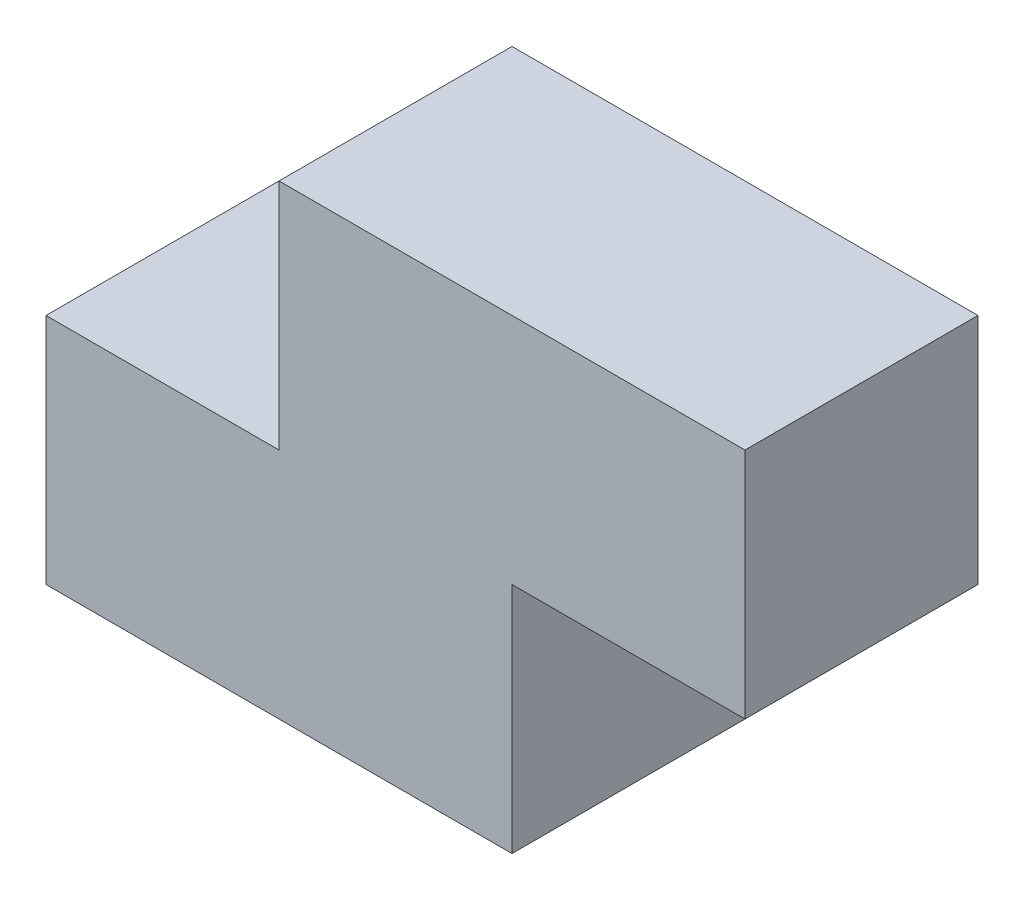
ISO-10303-21;
HEADER;
FILE_DESCRIPTION(('STEP AP214'),'2;1');
FILE_NAME('part.step','',(''),(''),'','','');
FILE_SCHEMA(('AUTOMOTIVE_DESIGN { 1 0 10303 214 1 1 1 1 }'));
ENDSEC;
DATA;
#1=APPLICATION_CONTEXT('core data for automotive mechanical design processes');
#2=APPLICATION_PROTOCOL_DEFINITION('international standard','automotive_design',2000,#1);
#3=PRODUCT_CONTEXT('',#1,'mechanical');
#4=PRODUCT('Part','Part','',(#3));
#5=PRODUCT_RELATED_PRODUCT_CATEGORY('part','',(#4));
#6=PRODUCT_DEFINITION_FORMATION('','',#4);
#7=PRODUCT_DEFINITION_CONTEXT('part definition',#1,'design');
#8=PRODUCT_DEFINITION('design','',#6,#7);
#9=PRODUCT_DEFINITION_SHAPE('','',#8);
#10=(LENGTH_UNIT() NAMED_UNIT(*) SI_UNIT(.MILLI.,.METRE.));
#11=(NAMED_UNIT(*) PLANE_ANGLE_UNIT() SI_UNIT($,.RADIAN.));
#12=(NAMED_UNIT(*) SI_UNIT($,.STERADIAN.) SOLID_ANGLE_UNIT());
#13=UNCERTAINTY_MEASURE_WITH_UNIT(LENGTH_MEASURE(1.E-05),#10,'distance_accuracy_value','');
#14=(GEOMETRIC_REPRESENTATION_CONTEXT(3) GLOBAL_UNCERTAINTY_ASSIGNED_CONTEXT((#13)) GLOBAL_UNIT_ASSIGNED_CONTEXT((#10,
#11,#12)) REPRESENTATION_CONTEXT('',''));
#15=CARTESIAN_POINT('',(0.,0.,0.));
#16=DIRECTION('',(0.,0.,1.));
#17=DIRECTION('',(1.,0.,0.));
#18=AXIS2_PLACEMENT_3D('',#15,#16,#17);
#19=CARTESIAN_POINT('',(0.,30.,30.));
#20=DIRECTION('',(1.,0.,0.));
#21=DIRECTION('',(0.,1.,0.));
#22=AXIS2_PLACEMENT_3D('',#19,#20,#21);
#23=PLANE('',#22);
#24=DIRECTION('',(0.,-1.,0.));
#25=VECTOR('',#24,1.);
#26=CARTESIAN_POINT('',(0.,30.,0.));
#27=LINE('',#26,#25);
#28=CARTESIAN_POINT('',(0.,30.,0.));
#29=VERTEX_POINT('',#28);
#30=CARTESIAN_POINT('',(0.,0.,0.));
#31=VERTEX_POINT('',#30);
#32=EDGE_CURVE('E129',#29,#31,#27,.T.);
#33=ORIENTED_EDGE('',*,*,#32,.T.);
#34=DIRECTION('',(0.,0.,-1.));
#35=VECTOR('',#34,1.);
#36=CARTESIAN_POINT('',(0.,0.,30.));
#37=LINE('',#36,#35);
#38=CARTESIAN_POINT('',(0.,0.,30.));
#39=VERTEX_POINT('',#38);
#40=EDGE_CURVE('E11',#39,#31,#37,.T.);
#41=ORIENTED_EDGE('',*,*,#40,.F.);
#42=DIRECTION('',(0.,-1.,0.));
#43=VECTOR('',#42,1.);
#44=CARTESIAN_POINT('',(0.,30.,30.));
#45=LINE('',#44,#43);
#46=CARTESIAN_POINT('',(0.,30.,30.));
#47=VERTEX_POINT('',#46);
#48=EDGE_CURVE('E143',#47,#39,#45,.T.);
#49=ORIENTED_EDGE('',*,*,#48,.F.);
#50=DIRECTION('',(0.,0.,-1.));
#51=VECTOR('',#50,1.);
#52=CARTESIAN_POINT('',(0.,30.,30.));
#53=LINE('',#52,#51);
#54=EDGE_CURVE('E125',#47,#29,#53,.T.);
#55=ORIENTED_EDGE('',*,*,#54,.T.);
#56=EDGE_LOOP('',(#33,#41,#49,#55));
#57=FACE_BOUND('',#56,.T.);
#58=ADVANCED_FACE('F33',(#57),#23,.F.);
#59=CARTESIAN_POINT('',(0.,0.,30.));
#60=DIRECTION('',(0.,1.,0.));
#61=DIRECTION('',(0.,0.,1.));
#62=AXIS2_PLACEMENT_3D('',#59,#60,#61);
#63=PLANE('',#62);
#64=DIRECTION('',(1.,0.,0.));
#65=VECTOR('',#64,1.);
#66=CARTESIAN_POINT('',(0.,0.,0.));
#67=LINE('',#66,#65);
#68=CARTESIAN_POINT('',(60.,0.,0.));
#69=VERTEX_POINT('',#68);
#70=EDGE_CURVE('E132',#31,#69,#67,.T.);
#71=ORIENTED_EDGE('',*,*,#70,.T.);
#72=DIRECTION('',(0.,0.,-1.));
#73=VECTOR('',#72,1.);
#74=CARTESIAN_POINT('',(60.,0.,30.));
#75=LINE('',#74,#73);
#76=CARTESIAN_POINT('',(60.,0.,30.));
#77=VERTEX_POINT('',#76);
#78=EDGE_CURVE('E41',#77,#69,#75,.T.);
#79=ORIENTED_EDGE('',*,*,#78,.F.);
#80=DIRECTION('',(1.,0.,0.));
#81=VECTOR('',#80,1.);
#82=CARTESIAN_POINT('',(0.,0.,30.));
#83=LINE('',#82,#81);
#84=EDGE_CURVE('E92',#39,#77,#83,.T.);
#85=ORIENTED_EDGE('',*,*,#84,.F.);
#86=ORIENTED_EDGE('',*,*,#40,.T.);
#87=EDGE_LOOP('',(#71,#79,#85,#86));
#88=FACE_BOUND('',#87,.T.);
#89=ADVANCED_FACE('F178',(#88),#63,.F.);
#90=CARTESIAN_POINT('',(60.,0.,30.));
#91=DIRECTION('',(-1.,0.,0.));
#92=DIRECTION('',(0.,0.,1.));
#93=AXIS2_PLACEMENT_3D('',#90,#91,#92);
#94=PLANE('',#93);
#95=DIRECTION('',(0.,1.,0.));
#96=VECTOR('',#95,1.);
#97=CARTESIAN_POINT('',(60.,0.,0.));
#98=LINE('',#97,#96);
#99=CARTESIAN_POINT('',(60.,30.,0.));
#100=VERTEX_POINT('',#99);
#101=EDGE_CURVE('E134',#69,#100,#98,.T.);
#102=ORIENTED_EDGE('',*,*,#101,.T.);
#103=DIRECTION('',(0.,0.,-1.));
#104=VECTOR('',#103,1.);
#105=CARTESIAN_POINT('',(60.,30.,30.));
#106=LINE('',#105,#104);
#107=CARTESIAN_POINT('',(60.,30.,30.));
#108=VERTEX_POINT('',#107);
#109=EDGE_CURVE('E150',#108,#100,#106,.T.);
#110=ORIENTED_EDGE('',*,*,#109,.F.);
#111=DIRECTION('',(0.,1.,0.));
#112=VECTOR('',#111,1.);
#113=CARTESIAN_POINT('',(60.,0.,30.));
#114=LINE('',#113,#112);
#115=EDGE_CURVE('E158',#77,#108,#114,.T.);
#116=ORIENTED_EDGE('',*,*,#115,.F.);
#117=ORIENTED_EDGE('',*,*,#78,.T.);
#118=EDGE_LOOP('',(#102,#110,#116,#117));
#119=FACE_BOUND('',#118,.T.);
#120=ADVANCED_FACE('F156',(#119),#94,.F.);
#121=CARTESIAN_POINT('',(60.,30.,30.));
#122=DIRECTION('',(0.,1.,0.));
#123=DIRECTION('',(-1.,0.,0.));
#124=AXIS2_PLACEMENT_3D('',#121,#122,#123);
#125=PLANE('',#124);
#126=DIRECTION('',(1.,0.,0.));
#127=VECTOR('',#126,1.);
#128=CARTESIAN_POINT('',(60.,30.,0.));
#129=LINE('',#128,#127);
#130=CARTESIAN_POINT('',(90.,30.,0.));
#131=VERTEX_POINT('',#130);
#132=EDGE_CURVE('E136',#100,#131,#129,.T.);
#133=ORIENTED_EDGE('',*,*,#132,.T.);
#134=DIRECTION('',(0.,0.,-1.));
#135=VECTOR('',#134,1.);
#136=CARTESIAN_POINT('',(90.,30.,30.));
#137=LINE('',#136,#135);
#138=CARTESIAN_POINT('',(90.,30.,30.));
#139=VERTEX_POINT('',#138);
#140=EDGE_CURVE('E147',#139,#131,#137,.T.);
#141=ORIENTED_EDGE('',*,*,#140,.F.);
#142=DIRECTION('',(1.,0.,0.));
#143=VECTOR('',#142,1.);
#144=CARTESIAN_POINT('',(60.,30.,30.));
#145=LINE('',#144,#143);
#146=EDGE_CURVE('E170',#108,#139,#145,.T.);
#147=ORIENTED_EDGE('',*,*,#146,.F.);
#148=ORIENTED_EDGE('',*,*,#109,.T.);
#149=EDGE_LOOP('',(#133,#141,#147,#148));
#150=FACE_BOUND('',#149,.T.);
#151=ADVANCED_FACE('F166',(#150),#125,.F.);
#152=CARTESIAN_POINT('',(90.,30.,30.));
#153=DIRECTION('',(-1.,0.,0.));
#154=DIRECTION('',(0.,0.,1.));
#155=AXIS2_PLACEMENT_3D('',#152,#153,#154);
#156=PLANE('',#155);
#157=DIRECTION('',(0.,1.,0.));
#158=VECTOR('',#157,1.);
#159=CARTESIAN_POINT('',(90.,30.,0.));
#160=LINE('',#159,#158);
#161=CARTESIAN_POINT('',(90.,60.,0.));
#162=VERTEX_POINT('',#161);
#163=EDGE_CURVE('E138',#131,#162,#160,.T.);
#164=ORIENTED_EDGE('',*,*,#163,.T.);
#165=DIRECTION('',(0.,0.,-1.));
#166=VECTOR('',#165,1.);
#167=CARTESIAN_POINT('',(90.,60.,30.));
#168=LINE('',#167,#166);
#169=CARTESIAN_POINT('',(90.,60.,30.));
#170=VERTEX_POINT('',#169);
#171=EDGE_CURVE('E120',#170,#162,#168,.T.);
#172=ORIENTED_EDGE('',*,*,#171,.F.);
#173=DIRECTION('',(0.,1.,0.));
#174=VECTOR('',#173,1.);
#175=CARTESIAN_POINT('',(90.,30.,30.));
#176=LINE('',#175,#174);
#177=EDGE_CURVE('E111',#139,#170,#176,.T.);
#178=ORIENTED_EDGE('',*,*,#177,.F.);
#179=ORIENTED_EDGE('',*,*,#140,.T.);
#180=EDGE_LOOP('',(#164,#172,#178,#179));
#181=FACE_BOUND('',#180,.T.);
#182=ADVANCED_FACE('F169',(#181),#156,.F.);
#183=CARTESIAN_POINT('',(90.,60.,30.));
#184=DIRECTION('',(0.,-1.,0.));
#185=DIRECTION('',(1.,0.,0.));
#186=AXIS2_PLACEMENT_3D('',#183,#184,#185);
#187=PLANE('',#186);
#188=DIRECTION('',(-1.,0.,0.));
#189=VECTOR('',#188,1.);
#190=CARTESIAN_POINT('',(90.,60.,0.));
#191=LINE('',#190,#189);
#192=CARTESIAN_POINT('',(30.,60.,0.));
#193=VERTEX_POINT('',#192);
#194=EDGE_CURVE('E119',#162,#193,#191,.T.);
#195=ORIENTED_EDGE('',*,*,#194,.T.);
#196=DIRECTION('',(0.,0.,-1.));
#197=VECTOR('',#196,1.);
#198=CARTESIAN_POINT('',(30.,60.,30.));
#199=LINE('',#198,#197);
#200=CARTESIAN_POINT('',(30.,60.,30.));
#201=VERTEX_POINT('',#200);
#202=EDGE_CURVE('E116',#201,#193,#199,.T.);
#203=ORIENTED_EDGE('',*,*,#202,.F.);
#204=DIRECTION('',(-1.,0.,0.));
#205=VECTOR('',#204,1.);
#206=CARTESIAN_POINT('',(90.,60.,30.));
#207=LINE('',#206,#205);
#208=EDGE_CURVE('E105',#170,#201,#207,.T.);
#209=ORIENTED_EDGE('',*,*,#208,.F.);
#210=ORIENTED_EDGE('',*,*,#171,.T.);
#211=EDGE_LOOP('',(#195,#203,#209,#210));
#212=FACE_BOUND('',#211,.T.);
#213=ADVANCED_FACE('F117',(#212),#187,.F.);
#214=CARTESIAN_POINT('',(30.,60.,30.));
#215=DIRECTION('',(1.,0.,0.));
#216=DIRECTION('',(0.,1.,0.));
#217=AXIS2_PLACEMENT_3D('',#214,#215,#216);
#218=PLANE('',#217);
#219=DIRECTION('',(0.,-1.,0.));
#220=VECTOR('',#219,1.);
#221=CARTESIAN_POINT('',(30.,60.,0.));
#222=LINE('',#221,#220);
#223=CARTESIAN_POINT('',(30.,30.,0.));
#224=VERTEX_POINT('',#223);
#225=EDGE_CURVE('E78',#193,#224,#222,.T.);
#226=ORIENTED_EDGE('',*,*,#225,.T.);
#227=DIRECTION('',(0.,0.,-1.));
#228=VECTOR('',#227,1.);
#229=CARTESIAN_POINT('',(30.,30.,30.));
#230=LINE('',#229,#228);
#231=CARTESIAN_POINT('',(30.,30.,30.));
#232=VERTEX_POINT('',#231);
#233=EDGE_CURVE('E121',#232,#224,#230,.T.);
#234=ORIENTED_EDGE('',*,*,#233,.F.);
#235=DIRECTION('',(0.,-1.,0.));
#236=VECTOR('',#235,1.);
#237=CARTESIAN_POINT('',(30.,60.,30.));
#238=LINE('',#237,#236);
#239=EDGE_CURVE('E109',#201,#232,#238,.T.);
#240=ORIENTED_EDGE('',*,*,#239,.F.);
#241=ORIENTED_EDGE('',*,*,#202,.T.);
#242=EDGE_LOOP('',(#226,#234,#240,#241));
#243=FACE_BOUND('',#242,.T.);
#244=ADVANCED_FACE('F123',(#243),#218,.F.);
#245=CARTESIAN_POINT('',(30.,30.,30.));
#246=DIRECTION('',(0.,-1.,0.));
#247=DIRECTION('',(1.,0.,0.));
#248=AXIS2_PLACEMENT_3D('',#245,#246,#247);
#249=PLANE('',#248);
#250=DIRECTION('',(-1.,0.,0.));
#251=VECTOR('',#250,1.);
#252=CARTESIAN_POINT('',(30.,30.,0.));
#253=LINE('',#252,#251);
#254=EDGE_CURVE('E84',#224,#29,#253,.T.);
#255=ORIENTED_EDGE('',*,*,#254,.T.);
#256=ORIENTED_EDGE('',*,*,#54,.F.);
#257=DIRECTION('',(-1.,0.,0.));
#258=VECTOR('',#257,1.);
#259=CARTESIAN_POINT('',(30.,30.,30.));
#260=LINE('',#259,#258);
#261=EDGE_CURVE('E49',#232,#47,#260,.T.);
#262=ORIENTED_EDGE('',*,*,#261,.F.);
#263=ORIENTED_EDGE('',*,*,#233,.T.);
#264=EDGE_LOOP('',(#255,#256,#262,#263));
#265=FACE_BOUND('',#264,.T.);
#266=ADVANCED_FACE('F194',(#265),#249,.F.);
#267=CARTESIAN_POINT('',(0.,0.,30.));
#268=DIRECTION('',(0.,0.,1.));
#269=DIRECTION('',(1.,0.,0.));
#270=AXIS2_PLACEMENT_3D('',#267,#268,#269);
#271=PLANE('',#270);
#272=ORIENTED_EDGE('',*,*,#48,.T.);
#273=ORIENTED_EDGE('',*,*,#84,.T.);
#274=ORIENTED_EDGE('',*,*,#115,.T.);
#275=ORIENTED_EDGE('',*,*,#146,.T.);
#276=ORIENTED_EDGE('',*,*,#177,.T.);
#277=ORIENTED_EDGE('',*,*,#208,.T.);
#278=ORIENTED_EDGE('',*,*,#239,.T.);
#279=ORIENTED_EDGE('',*,*,#261,.T.);
#280=EDGE_LOOP('',(#272,#273,#274,#275,#276,#277,#278,#279));
#281=FACE_BOUND('',#280,.T.);
#282=ADVANCED_FACE('F107',(#281),#271,.T.);
#283=CARTESIAN_POINT('',(0.,0.,0.));
#284=DIRECTION('',(0.,0.,1.));
#285=DIRECTION('',(1.,0.,0.));
#286=AXIS2_PLACEMENT_3D('',#283,#284,#285);
#287=PLANE('',#286);
#288=ORIENTED_EDGE('',*,*,#32,.F.);
#289=ORIENTED_EDGE('',*,*,#254,.F.);
#290=ORIENTED_EDGE('',*,*,#225,.F.);
#291=ORIENTED_EDGE('',*,*,#194,.F.);
#292=ORIENTED_EDGE('',*,*,#163,.F.);
#293=ORIENTED_EDGE('',*,*,#132,.F.);
#294=ORIENTED_EDGE('',*,*,#101,.F.);
#295=ORIENTED_EDGE('',*,*,#70,.F.);
#296=EDGE_LOOP('',(#288,#289,#290,#291,#292,#293,#294,#295));
#297=FACE_BOUND('',#296,.T.);
#298=ADVANCED_FACE('F162',(#297),#287,.F.);
#299=CLOSED_SHELL('',(#58,#89,#120,#151,#182,#213,#244,#266,#282,#298));
#300=MANIFOLD_SOLID_BREP('B2',#299);
#301=ADVANCED_BREP_SHAPE_REPRESENTATION('',(#18,#300),#14);
#302=SHAPE_DEFINITION_REPRESENTATION(#9,#301);
ENDSEC;
END-ISO-10303-21;
